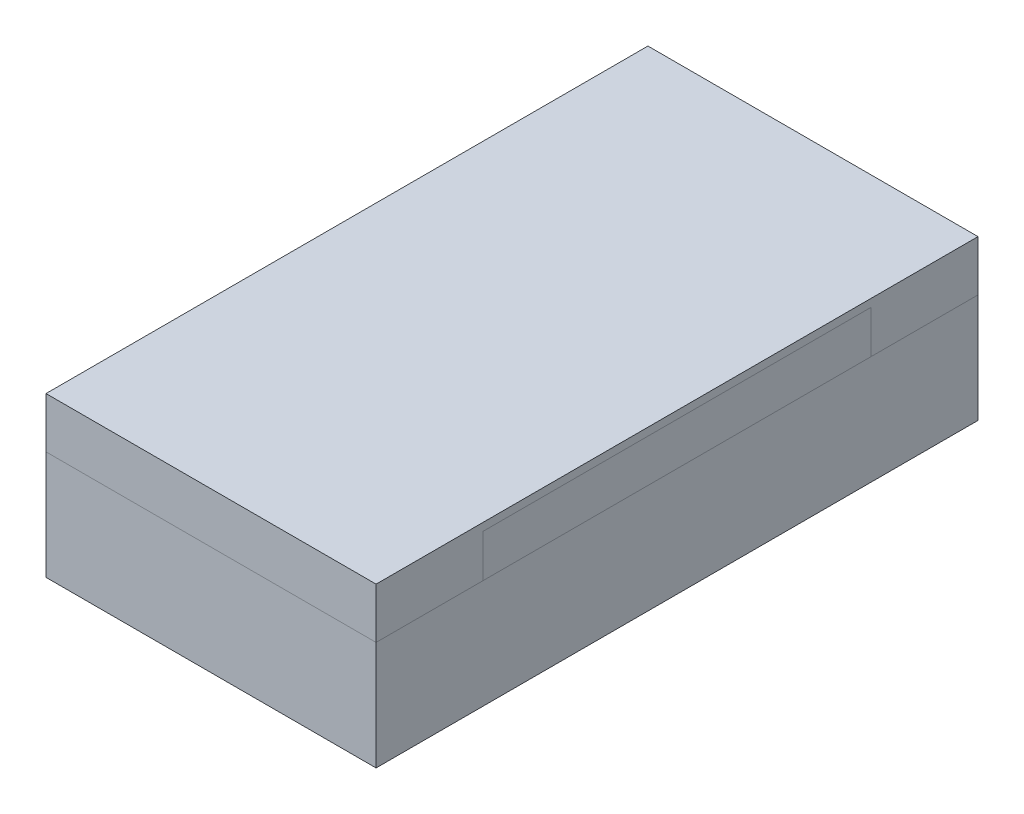
ISO-10303-21;
HEADER;
FILE_DESCRIPTION(('STEP AP214'),'2;1');
FILE_NAME('part.step','',(''),(''),'','','');
FILE_SCHEMA(('AUTOMOTIVE_DESIGN { 1 0 10303 214 1 1 1 1 }'));
ENDSEC;
DATA;
#1=APPLICATION_CONTEXT('core data for automotive mechanical design processes');
#2=APPLICATION_PROTOCOL_DEFINITION('international standard','automotive_design',2000,#1);
#3=PRODUCT_CONTEXT('',#1,'mechanical');
#4=PRODUCT('Part','Part','',(#3));
#5=PRODUCT_RELATED_PRODUCT_CATEGORY('part','',(#4));
#6=PRODUCT_DEFINITION_FORMATION('','',#4);
#7=PRODUCT_DEFINITION_CONTEXT('part definition',#1,'design');
#8=PRODUCT_DEFINITION('design','',#6,#7);
#9=PRODUCT_DEFINITION_SHAPE('','',#8);
#10=(LENGTH_UNIT() NAMED_UNIT(*) SI_UNIT(.MILLI.,.METRE.));
#11=(NAMED_UNIT(*) PLANE_ANGLE_UNIT() SI_UNIT($,.RADIAN.));
#12=(NAMED_UNIT(*) SI_UNIT($,.STERADIAN.) SOLID_ANGLE_UNIT());
#13=UNCERTAINTY_MEASURE_WITH_UNIT(LENGTH_MEASURE(1.E-05),#10,'distance_accuracy_value','');
#14=(GEOMETRIC_REPRESENTATION_CONTEXT(3) GLOBAL_UNCERTAINTY_ASSIGNED_CONTEXT((#13)) GLOBAL_UNIT_ASSIGNED_CONTEXT((#10,
#11,#12)) REPRESENTATION_CONTEXT('',''));
#15=CARTESIAN_POINT('',(0.,0.,0.));
#16=DIRECTION('',(0.,0.,1.));
#17=DIRECTION('',(1.,0.,0.));
#18=AXIS2_PLACEMENT_3D('',#15,#16,#17);
#19=CARTESIAN_POINT('',(-0.425,0.41,-0.5));
#20=DIRECTION('',(1.,0.,0.));
#21=DIRECTION('',(0.,0.,-1.));
#22=AXIS2_PLACEMENT_3D('',#19,#20,#21);
#23=PLANE('',#22);
#24=DIRECTION('',(0.,0.,1.));
#25=VECTOR('',#24,1.);
#26=CARTESIAN_POINT('',(-0.425,0.39,-0.5));
#27=LINE('',#26,#25);
#28=CARTESIAN_POINT('',(-0.425,0.39,-0.5));
#29=VERTEX_POINT('',#28);
#30=CARTESIAN_POINT('',(-0.425,0.39,0.5));
#31=VERTEX_POINT('',#30);
#32=EDGE_CURVE('E162',#29,#31,#27,.T.);
#33=ORIENTED_EDGE('',*,*,#32,.T.);
#34=DIRECTION('',(0.,-1.,0.));
#35=VECTOR('',#34,1.);
#36=CARTESIAN_POINT('',(-0.425,1.30337841926028,0.5));
#37=LINE('',#36,#35);
#38=CARTESIAN_POINT('',(-0.425,0.28,0.5));
#39=VERTEX_POINT('',#38);
#40=EDGE_CURVE('E144',#31,#39,#37,.T.);
#41=ORIENTED_EDGE('',*,*,#40,.T.);
#42=DIRECTION('',(0.,0.,1.));
#43=VECTOR('',#42,1.);
#44=CARTESIAN_POINT('',(-0.425,0.28,0.5));
#45=LINE('',#44,#43);
#46=CARTESIAN_POINT('',(-0.425,0.28,0.775));
#47=VERTEX_POINT('',#46);
#48=EDGE_CURVE('E123',#39,#47,#45,.T.);
#49=ORIENTED_EDGE('',*,*,#48,.T.);
#50=DIRECTION('',(0.,-1.,0.));
#51=VECTOR('',#50,1.);
#52=CARTESIAN_POINT('',(-0.425,1.30337841926028,0.775));
#53=LINE('',#52,#51);
#54=CARTESIAN_POINT('',(-0.425,0.41,0.775));
#55=VERTEX_POINT('',#54);
#56=EDGE_CURVE('E121',#55,#47,#53,.T.);
#57=ORIENTED_EDGE('',*,*,#56,.F.);
#58=DIRECTION('',(0.,0.,1.));
#59=VECTOR('',#58,1.);
#60=CARTESIAN_POINT('',(-0.425,0.41,-0.5));
#61=LINE('',#60,#59);
#62=CARTESIAN_POINT('',(-0.425,0.41,-0.775));
#63=VERTEX_POINT('',#62);
#64=EDGE_CURVE('E54',#63,#55,#61,.T.);
#65=ORIENTED_EDGE('',*,*,#64,.F.);
#66=DIRECTION('',(0.,-1.,0.));
#67=VECTOR('',#66,1.);
#68=CARTESIAN_POINT('',(-0.425,1.30337841926028,-0.775));
#69=LINE('',#68,#67);
#70=CARTESIAN_POINT('',(-0.425,0.28,-0.775));
#71=VERTEX_POINT('',#70);
#72=EDGE_CURVE('E154',#63,#71,#69,.T.);
#73=ORIENTED_EDGE('',*,*,#72,.T.);
#74=DIRECTION('',(0.,0.,1.));
#75=VECTOR('',#74,1.);
#76=CARTESIAN_POINT('',(-0.425,0.28,-0.775));
#77=LINE('',#76,#75);
#78=CARTESIAN_POINT('',(-0.425,0.28,-0.5));
#79=VERTEX_POINT('',#78);
#80=EDGE_CURVE('E151',#71,#79,#77,.T.);
#81=ORIENTED_EDGE('',*,*,#80,.T.);
#82=DIRECTION('',(0.,-1.,0.));
#83=VECTOR('',#82,1.);
#84=CARTESIAN_POINT('',(-0.425,1.30337841926028,-0.5));
#85=LINE('',#84,#83);
#86=EDGE_CURVE('E150',#29,#79,#85,.T.);
#87=ORIENTED_EDGE('',*,*,#86,.F.);
#88=EDGE_LOOP('',(#33,#41,#49,#57,#65,#73,#81,#87));
#89=FACE_BOUND('',#88,.T.);
#90=ADVANCED_FACE('F46',(#89),#23,.F.);
#91=CARTESIAN_POINT('',(0.425,0.41,-0.5));
#92=DIRECTION('',(-1.,0.,0.));
#93=DIRECTION('',(0.,0.,1.));
#94=AXIS2_PLACEMENT_3D('',#91,#92,#93);
#95=PLANE('',#94);
#96=DIRECTION('',(0.,0.,-1.));
#97=VECTOR('',#96,1.);
#98=CARTESIAN_POINT('',(0.425,0.39,-0.5));
#99=LINE('',#98,#97);
#100=CARTESIAN_POINT('',(0.425,0.39,0.5));
#101=VERTEX_POINT('',#100);
#102=CARTESIAN_POINT('',(0.425,0.39,-0.5));
#103=VERTEX_POINT('',#102);
#104=EDGE_CURVE('E62',#101,#103,#99,.T.);
#105=ORIENTED_EDGE('',*,*,#104,.T.);
#106=DIRECTION('',(0.,-1.,0.));
#107=VECTOR('',#106,1.);
#108=CARTESIAN_POINT('',(0.425,1.30337841926028,-0.5));
#109=LINE('',#108,#107);
#110=CARTESIAN_POINT('',(0.425,0.28,-0.5));
#111=VERTEX_POINT('',#110);
#112=EDGE_CURVE('E132',#103,#111,#109,.T.);
#113=ORIENTED_EDGE('',*,*,#112,.T.);
#114=DIRECTION('',(0.,0.,-1.));
#115=VECTOR('',#114,1.);
#116=CARTESIAN_POINT('',(0.425,0.28,-0.775));
#117=LINE('',#116,#115);
#118=CARTESIAN_POINT('',(0.425,0.28,-0.775));
#119=VERTEX_POINT('',#118);
#120=EDGE_CURVE('E134',#111,#119,#117,.T.);
#121=ORIENTED_EDGE('',*,*,#120,.T.);
#122=DIRECTION('',(0.,-1.,0.));
#123=VECTOR('',#122,1.);
#124=CARTESIAN_POINT('',(0.425,1.30337841926028,-0.775));
#125=LINE('',#124,#123);
#126=CARTESIAN_POINT('',(0.425,0.41,-0.775));
#127=VERTEX_POINT('',#126);
#128=EDGE_CURVE('E158',#127,#119,#125,.T.);
#129=ORIENTED_EDGE('',*,*,#128,.F.);
#130=DIRECTION('',(0.,0.,-1.));
#131=VECTOR('',#130,1.);
#132=CARTESIAN_POINT('',(0.425,0.41,-0.5));
#133=LINE('',#132,#131);
#134=CARTESIAN_POINT('',(0.425,0.41,0.775));
#135=VERTEX_POINT('',#134);
#136=EDGE_CURVE('E12',#135,#127,#133,.T.);
#137=ORIENTED_EDGE('',*,*,#136,.F.);
#138=DIRECTION('',(0.,-1.,0.));
#139=VECTOR('',#138,1.);
#140=CARTESIAN_POINT('',(0.425,1.30337841926028,0.775));
#141=LINE('',#140,#139);
#142=CARTESIAN_POINT('',(0.425,0.28,0.775));
#143=VERTEX_POINT('',#142);
#144=EDGE_CURVE('E131',#135,#143,#141,.T.);
#145=ORIENTED_EDGE('',*,*,#144,.T.);
#146=DIRECTION('',(0.,0.,-1.));
#147=VECTOR('',#146,1.);
#148=CARTESIAN_POINT('',(0.425,0.28,0.5));
#149=LINE('',#148,#147);
#150=CARTESIAN_POINT('',(0.425,0.28,0.5));
#151=VERTEX_POINT('',#150);
#152=EDGE_CURVE('E139',#143,#151,#149,.T.);
#153=ORIENTED_EDGE('',*,*,#152,.T.);
#154=DIRECTION('',(0.,-1.,0.));
#155=VECTOR('',#154,1.);
#156=CARTESIAN_POINT('',(0.425,1.30337841926028,0.5));
#157=LINE('',#156,#155);
#158=EDGE_CURVE('E141',#101,#151,#157,.T.);
#159=ORIENTED_EDGE('',*,*,#158,.F.);
#160=EDGE_LOOP('',(#105,#113,#121,#129,#137,#145,#153,#159));
#161=FACE_BOUND('',#160,.T.);
#162=ADVANCED_FACE('F180',(#161),#95,.F.);
#163=CARTESIAN_POINT('',(0.,0.41,0.));
#164=DIRECTION('',(0.,1.,0.));
#165=DIRECTION('',(0.,0.,1.));
#166=AXIS2_PLACEMENT_3D('',#163,#164,#165);
#167=PLANE('',#166);
#168=ORIENTED_EDGE('',*,*,#64,.T.);
#169=DIRECTION('',(1.,0.,0.));
#170=VECTOR('',#169,1.);
#171=CARTESIAN_POINT('',(0.425,0.41,0.775));
#172=LINE('',#171,#170);
#173=EDGE_CURVE('E114',#55,#135,#172,.T.);
#174=ORIENTED_EDGE('',*,*,#173,.T.);
#175=ORIENTED_EDGE('',*,*,#136,.T.);
#176=DIRECTION('',(-1.,0.,0.));
#177=VECTOR('',#176,1.);
#178=CARTESIAN_POINT('',(0.425,0.41,-0.775));
#179=LINE('',#178,#177);
#180=EDGE_CURVE('E116',#127,#63,#179,.T.);
#181=ORIENTED_EDGE('',*,*,#180,.T.);
#182=EDGE_LOOP('',(#168,#174,#175,#181));
#183=FACE_BOUND('',#182,.T.);
#184=ADVANCED_FACE('F112',(#183),#167,.T.);
#185=CARTESIAN_POINT('',(0.,0.39,0.));
#186=DIRECTION('',(0.,1.,0.));
#187=DIRECTION('',(0.,0.,1.));
#188=AXIS2_PLACEMENT_3D('',#185,#186,#187);
#189=PLANE('',#188);
#190=ORIENTED_EDGE('',*,*,#32,.F.);
#191=DIRECTION('',(-1.,0.,0.));
#192=VECTOR('',#191,1.);
#193=CARTESIAN_POINT('',(-0.425,0.39,-0.5));
#194=LINE('',#193,#192);
#195=EDGE_CURVE('E49',#103,#29,#194,.T.);
#196=ORIENTED_EDGE('',*,*,#195,.F.);
#197=ORIENTED_EDGE('',*,*,#104,.F.);
#198=DIRECTION('',(1.,0.,0.));
#199=VECTOR('',#198,1.);
#200=CARTESIAN_POINT('',(-0.425,0.39,0.5));
#201=LINE('',#200,#199);
#202=EDGE_CURVE('E69',#31,#101,#201,.T.);
#203=ORIENTED_EDGE('',*,*,#202,.F.);
#204=EDGE_LOOP('',(#190,#196,#197,#203));
#205=FACE_BOUND('',#204,.T.);
#206=ADVANCED_FACE('F191',(#205),#189,.F.);
#207=CARTESIAN_POINT('',(0.425,1.30337841926028,-0.5));
#208=DIRECTION('',(0.,0.,-1.));
#209=DIRECTION('',(-1.,0.,0.));
#210=AXIS2_PLACEMENT_3D('',#207,#208,#209);
#211=PLANE('',#210);
#212=ORIENTED_EDGE('',*,*,#112,.F.);
#213=ORIENTED_EDGE('',*,*,#195,.T.);
#214=ORIENTED_EDGE('',*,*,#86,.T.);
#215=DIRECTION('',(1.,0.,0.));
#216=VECTOR('',#215,1.);
#217=CARTESIAN_POINT('',(0.425,0.28,-0.5));
#218=LINE('',#217,#216);
#219=EDGE_CURVE('E147',#79,#111,#218,.T.);
#220=ORIENTED_EDGE('',*,*,#219,.T.);
#221=EDGE_LOOP('',(#212,#213,#214,#220));
#222=FACE_BOUND('',#221,.T.);
#223=ADVANCED_FACE('F171',(#222),#211,.F.);
#224=CARTESIAN_POINT('',(0.425,1.30337841926028,-0.775));
#225=DIRECTION('',(0.,0.,1.));
#226=DIRECTION('',(1.,0.,0.));
#227=AXIS2_PLACEMENT_3D('',#224,#225,#226);
#228=PLANE('',#227);
#229=ORIENTED_EDGE('',*,*,#180,.F.);
#230=ORIENTED_EDGE('',*,*,#128,.T.);
#231=DIRECTION('',(-1.,0.,0.));
#232=VECTOR('',#231,1.);
#233=CARTESIAN_POINT('',(0.425,0.28,-0.775));
#234=LINE('',#233,#232);
#235=EDGE_CURVE('E155',#119,#71,#234,.T.);
#236=ORIENTED_EDGE('',*,*,#235,.T.);
#237=ORIENTED_EDGE('',*,*,#72,.F.);
#238=EDGE_LOOP('',(#229,#230,#236,#237));
#239=FACE_BOUND('',#238,.T.);
#240=ADVANCED_FACE('F182',(#239),#228,.F.);
#241=CARTESIAN_POINT('',(0.,0.28,0.));
#242=DIRECTION('',(0.,-1.,0.));
#243=DIRECTION('',(0.,0.,-1.));
#244=AXIS2_PLACEMENT_3D('',#241,#242,#243);
#245=PLANE('',#244);
#246=ORIENTED_EDGE('',*,*,#120,.F.);
#247=ORIENTED_EDGE('',*,*,#219,.F.);
#248=ORIENTED_EDGE('',*,*,#80,.F.);
#249=ORIENTED_EDGE('',*,*,#235,.F.);
#250=EDGE_LOOP('',(#246,#247,#248,#249));
#251=FACE_BOUND('',#250,.T.);
#252=ADVANCED_FACE('F178',(#251),#245,.T.);
#253=CARTESIAN_POINT('',(0.425,1.30337841926028,0.5));
#254=DIRECTION('',(0.,0.,1.));
#255=DIRECTION('',(1.,0.,0.));
#256=AXIS2_PLACEMENT_3D('',#253,#254,#255);
#257=PLANE('',#256);
#258=ORIENTED_EDGE('',*,*,#40,.F.);
#259=ORIENTED_EDGE('',*,*,#202,.T.);
#260=ORIENTED_EDGE('',*,*,#158,.T.);
#261=DIRECTION('',(-1.,0.,0.));
#262=VECTOR('',#261,1.);
#263=CARTESIAN_POINT('',(0.425,0.28,0.5));
#264=LINE('',#263,#262);
#265=EDGE_CURVE('E143',#151,#39,#264,.T.);
#266=ORIENTED_EDGE('',*,*,#265,.T.);
#267=EDGE_LOOP('',(#258,#259,#260,#266));
#268=FACE_BOUND('',#267,.T.);
#269=ADVANCED_FACE('F189',(#268),#257,.F.);
#270=CARTESIAN_POINT('',(0.425,1.30337841926028,0.775));
#271=DIRECTION('',(0.,0.,-1.));
#272=DIRECTION('',(-1.,0.,0.));
#273=AXIS2_PLACEMENT_3D('',#270,#271,#272);
#274=PLANE('',#273);
#275=ORIENTED_EDGE('',*,*,#173,.F.);
#276=ORIENTED_EDGE('',*,*,#56,.T.);
#277=DIRECTION('',(1.,0.,0.));
#278=VECTOR('',#277,1.);
#279=CARTESIAN_POINT('',(0.425,0.28,0.775));
#280=LINE('',#279,#278);
#281=EDGE_CURVE('E127',#47,#143,#280,.T.);
#282=ORIENTED_EDGE('',*,*,#281,.T.);
#283=ORIENTED_EDGE('',*,*,#144,.F.);
#284=EDGE_LOOP('',(#275,#276,#282,#283));
#285=FACE_BOUND('',#284,.T.);
#286=ADVANCED_FACE('F130',(#285),#274,.F.);
#287=CARTESIAN_POINT('',(0.,0.28,0.));
#288=DIRECTION('',(0.,-1.,0.));
#289=DIRECTION('',(0.,0.,-1.));
#290=AXIS2_PLACEMENT_3D('',#287,#288,#289);
#291=PLANE('',#290);
#292=ORIENTED_EDGE('',*,*,#152,.F.);
#293=ORIENTED_EDGE('',*,*,#281,.F.);
#294=ORIENTED_EDGE('',*,*,#48,.F.);
#295=ORIENTED_EDGE('',*,*,#265,.F.);
#296=EDGE_LOOP('',(#292,#293,#294,#295));
#297=FACE_BOUND('',#296,.T.);
#298=ADVANCED_FACE('F240',(#297),#291,.T.);
#299=CLOSED_SHELL('',(#90,#162,#184,#206,#223,#240,#252,#269,#286,#298));
#300=MANIFOLD_SOLID_BREP('B2',#299);
#301=CARTESIAN_POINT('',(0.425,0.39,-0.5));
#302=DIRECTION('',(-1.,0.,0.));
#303=DIRECTION('',(0.,0.,1.));
#304=AXIS2_PLACEMENT_3D('',#301,#302,#303);
#305=PLANE('',#304);
#306=DIRECTION('',(0.,0.,-1.));
#307=VECTOR('',#306,1.);
#308=CARTESIAN_POINT('',(0.425,0.28,-0.5));
#309=LINE('',#308,#307);
#310=CARTESIAN_POINT('',(0.425,0.28,0.5));
#311=VERTEX_POINT('',#310);
#312=CARTESIAN_POINT('',(0.425,0.28,-0.5));
#313=VERTEX_POINT('',#312);
#314=EDGE_CURVE('E364',#311,#313,#309,.T.);
#315=ORIENTED_EDGE('',*,*,#314,.T.);
#316=DIRECTION('',(0.,-1.,0.));
#317=VECTOR('',#316,1.);
#318=CARTESIAN_POINT('',(0.425,0.39,-0.5));
#319=LINE('',#318,#317);
#320=CARTESIAN_POINT('',(0.425,0.39,-0.5));
#321=VERTEX_POINT('',#320);
#322=EDGE_CURVE('E44',#321,#313,#319,.T.);
#323=ORIENTED_EDGE('',*,*,#322,.F.);
#324=DIRECTION('',(0.,0.,-1.));
#325=VECTOR('',#324,1.);
#326=CARTESIAN_POINT('',(0.425,0.39,-0.5));
#327=LINE('',#326,#325);
#328=CARTESIAN_POINT('',(0.425,0.39,0.5));
#329=VERTEX_POINT('',#328);
#330=EDGE_CURVE('E352',#329,#321,#327,.T.);
#331=ORIENTED_EDGE('',*,*,#330,.F.);
#332=DIRECTION('',(0.,-1.,0.));
#333=VECTOR('',#332,1.);
#334=CARTESIAN_POINT('',(0.425,0.39,0.5));
#335=LINE('',#334,#333);
#336=EDGE_CURVE('E360',#329,#311,#335,.T.);
#337=ORIENTED_EDGE('',*,*,#336,.T.);
#338=EDGE_LOOP('',(#315,#323,#331,#337));
#339=FACE_BOUND('',#338,.T.);
#340=ADVANCED_FACE('F301',(#339),#305,.F.);
#341=CARTESIAN_POINT('',(0.425,0.39,-0.5));
#342=DIRECTION('',(0.,0.,1.));
#343=DIRECTION('',(1.,0.,0.));
#344=AXIS2_PLACEMENT_3D('',#341,#342,#343);
#345=PLANE('',#344);
#346=DIRECTION('',(-1.,0.,0.));
#347=VECTOR('',#346,1.);
#348=CARTESIAN_POINT('',(0.425,0.28,-0.5));
#349=LINE('',#348,#347);
#350=CARTESIAN_POINT('',(-0.425,0.28,-0.5));
#351=VERTEX_POINT('',#350);
#352=EDGE_CURVE('E356',#313,#351,#349,.T.);
#353=ORIENTED_EDGE('',*,*,#352,.T.);
#354=DIRECTION('',(0.,-1.,0.));
#355=VECTOR('',#354,1.);
#356=CARTESIAN_POINT('',(-0.425,0.39,-0.5));
#357=LINE('',#356,#355);
#358=CARTESIAN_POINT('',(-0.425,0.39,-0.5));
#359=VERTEX_POINT('',#358);
#360=EDGE_CURVE('E309',#359,#351,#357,.T.);
#361=ORIENTED_EDGE('',*,*,#360,.F.);
#362=DIRECTION('',(-1.,0.,0.));
#363=VECTOR('',#362,1.);
#364=CARTESIAN_POINT('',(0.425,0.39,-0.5));
#365=LINE('',#364,#363);
#366=EDGE_CURVE('E347',#321,#359,#365,.T.);
#367=ORIENTED_EDGE('',*,*,#366,.F.);
#368=ORIENTED_EDGE('',*,*,#322,.T.);
#369=EDGE_LOOP('',(#353,#361,#367,#368));
#370=FACE_BOUND('',#369,.T.);
#371=ADVANCED_FACE('F355',(#370),#345,.F.);
#372=CARTESIAN_POINT('',(-0.425,0.39,-0.5));
#373=DIRECTION('',(1.,0.,0.));
#374=DIRECTION('',(0.,0.,-1.));
#375=AXIS2_PLACEMENT_3D('',#372,#373,#374);
#376=PLANE('',#375);
#377=DIRECTION('',(0.,0.,1.));
#378=VECTOR('',#377,1.);
#379=CARTESIAN_POINT('',(-0.425,0.28,-0.5));
#380=LINE('',#379,#378);
#381=CARTESIAN_POINT('',(-0.425,0.28,0.5));
#382=VERTEX_POINT('',#381);
#383=EDGE_CURVE('E334',#351,#382,#380,.T.);
#384=ORIENTED_EDGE('',*,*,#383,.T.);
#385=DIRECTION('',(0.,-1.,0.));
#386=VECTOR('',#385,1.);
#387=CARTESIAN_POINT('',(-0.425,0.39,0.5));
#388=LINE('',#387,#386);
#389=CARTESIAN_POINT('',(-0.425,0.39,0.5));
#390=VERTEX_POINT('',#389);
#391=EDGE_CURVE('E357',#390,#382,#388,.T.);
#392=ORIENTED_EDGE('',*,*,#391,.F.);
#393=DIRECTION('',(0.,0.,1.));
#394=VECTOR('',#393,1.);
#395=CARTESIAN_POINT('',(-0.425,0.39,-0.5));
#396=LINE('',#395,#394);
#397=EDGE_CURVE('E350',#359,#390,#396,.T.);
#398=ORIENTED_EDGE('',*,*,#397,.F.);
#399=ORIENTED_EDGE('',*,*,#360,.T.);
#400=EDGE_LOOP('',(#384,#392,#398,#399));
#401=FACE_BOUND('',#400,.T.);
#402=ADVANCED_FACE('F358',(#401),#376,.F.);
#403=CARTESIAN_POINT('',(0.425,0.39,0.5));
#404=DIRECTION('',(0.,0.,-1.));
#405=DIRECTION('',(-1.,0.,0.));
#406=AXIS2_PLACEMENT_3D('',#403,#404,#405);
#407=PLANE('',#406);
#408=DIRECTION('',(1.,0.,0.));
#409=VECTOR('',#408,1.);
#410=CARTESIAN_POINT('',(0.425,0.28,0.5));
#411=LINE('',#410,#409);
#412=EDGE_CURVE('E340',#382,#311,#411,.T.);
#413=ORIENTED_EDGE('',*,*,#412,.T.);
#414=ORIENTED_EDGE('',*,*,#336,.F.);
#415=DIRECTION('',(1.,0.,0.));
#416=VECTOR('',#415,1.);
#417=CARTESIAN_POINT('',(0.425,0.39,0.5));
#418=LINE('',#417,#416);
#419=EDGE_CURVE('E317',#390,#329,#418,.T.);
#420=ORIENTED_EDGE('',*,*,#419,.F.);
#421=ORIENTED_EDGE('',*,*,#391,.T.);
#422=EDGE_LOOP('',(#413,#414,#420,#421));
#423=FACE_BOUND('',#422,.T.);
#424=ADVANCED_FACE('F371',(#423),#407,.F.);
#425=CARTESIAN_POINT('',(0.,0.39,0.));
#426=DIRECTION('',(0.,-1.,0.));
#427=DIRECTION('',(0.,0.,-1.));
#428=AXIS2_PLACEMENT_3D('',#425,#426,#427);
#429=PLANE('',#428);
#430=ORIENTED_EDGE('',*,*,#330,.T.);
#431=ORIENTED_EDGE('',*,*,#366,.T.);
#432=ORIENTED_EDGE('',*,*,#397,.T.);
#433=ORIENTED_EDGE('',*,*,#419,.T.);
#434=EDGE_LOOP('',(#430,#431,#432,#433));
#435=FACE_BOUND('',#434,.T.);
#436=ADVANCED_FACE('F348',(#435),#429,.F.);
#437=CARTESIAN_POINT('',(0.,0.28,0.));
#438=DIRECTION('',(0.,-1.,0.));
#439=DIRECTION('',(0.,0.,-1.));
#440=AXIS2_PLACEMENT_3D('',#437,#438,#439);
#441=PLANE('',#440);
#442=ORIENTED_EDGE('',*,*,#314,.F.);
#443=ORIENTED_EDGE('',*,*,#412,.F.);
#444=ORIENTED_EDGE('',*,*,#383,.F.);
#445=ORIENTED_EDGE('',*,*,#352,.F.);
#446=EDGE_LOOP('',(#442,#443,#444,#445));
#447=FACE_BOUND('',#446,.T.);
#448=ADVANCED_FACE('F374',(#447),#441,.T.);
#449=CLOSED_SHELL('',(#340,#371,#402,#424,#436,#448));
#450=MANIFOLD_SOLID_BREP('B6',#449);
#451=CARTESIAN_POINT('',(0.425,0.28,0.775));
#452=DIRECTION('',(-1.,0.,0.));
#453=DIRECTION('',(0.,0.,1.));
#454=AXIS2_PLACEMENT_3D('',#451,#452,#453);
#455=PLANE('',#454);
#456=DIRECTION('',(0.,0.,-1.));
#457=VECTOR('',#456,1.);
#458=CARTESIAN_POINT('',(0.425,0.,0.775));
#459=LINE('',#458,#457);
#460=CARTESIAN_POINT('',(0.425,0.,0.775));
#461=VERTEX_POINT('',#460);
#462=CARTESIAN_POINT('',(0.425,0.,-0.775));
#463=VERTEX_POINT('',#462);
#464=EDGE_CURVE('E488',#461,#463,#459,.T.);
#465=ORIENTED_EDGE('',*,*,#464,.T.);
#466=DIRECTION('',(0.,-1.,0.));
#467=VECTOR('',#466,1.);
#468=CARTESIAN_POINT('',(0.425,0.28,-0.775));
#469=LINE('',#468,#467);
#470=CARTESIAN_POINT('',(0.425,0.28,-0.775));
#471=VERTEX_POINT('',#470);
#472=EDGE_CURVE('E299',#471,#463,#469,.T.);
#473=ORIENTED_EDGE('',*,*,#472,.F.);
#474=DIRECTION('',(0.,0.,-1.));
#475=VECTOR('',#474,1.);
#476=CARTESIAN_POINT('',(0.425,0.28,0.775));
#477=LINE('',#476,#475);
#478=CARTESIAN_POINT('',(0.425,0.28,0.775));
#479=VERTEX_POINT('',#478);
#480=EDGE_CURVE('E476',#479,#471,#477,.T.);
#481=ORIENTED_EDGE('',*,*,#480,.F.);
#482=DIRECTION('',(0.,-1.,0.));
#483=VECTOR('',#482,1.);
#484=CARTESIAN_POINT('',(0.425,0.28,0.775));
#485=LINE('',#484,#483);
#486=EDGE_CURVE('E484',#479,#461,#485,.T.);
#487=ORIENTED_EDGE('',*,*,#486,.T.);
#488=EDGE_LOOP('',(#465,#473,#481,#487));
#489=FACE_BOUND('',#488,.T.);
#490=ADVANCED_FACE('F425',(#489),#455,.F.);
#491=CARTESIAN_POINT('',(-0.425,0.28,-0.775));
#492=DIRECTION('',(0.,0.,1.));
#493=DIRECTION('',(1.,0.,0.));
#494=AXIS2_PLACEMENT_3D('',#491,#492,#493);
#495=PLANE('',#494);
#496=DIRECTION('',(-1.,0.,0.));
#497=VECTOR('',#496,1.);
#498=CARTESIAN_POINT('',(-0.425,0.,-0.775));
#499=LINE('',#498,#497);
#500=CARTESIAN_POINT('',(-0.425,0.,-0.775));
#501=VERTEX_POINT('',#500);
#502=EDGE_CURVE('E480',#463,#501,#499,.T.);
#503=ORIENTED_EDGE('',*,*,#502,.T.);
#504=DIRECTION('',(0.,-1.,0.));
#505=VECTOR('',#504,1.);
#506=CARTESIAN_POINT('',(-0.425,0.28,-0.775));
#507=LINE('',#506,#505);
#508=CARTESIAN_POINT('',(-0.425,0.28,-0.775));
#509=VERTEX_POINT('',#508);
#510=EDGE_CURVE('E433',#509,#501,#507,.T.);
#511=ORIENTED_EDGE('',*,*,#510,.F.);
#512=DIRECTION('',(-1.,0.,0.));
#513=VECTOR('',#512,1.);
#514=CARTESIAN_POINT('',(-0.425,0.28,-0.775));
#515=LINE('',#514,#513);
#516=EDGE_CURVE('E471',#471,#509,#515,.T.);
#517=ORIENTED_EDGE('',*,*,#516,.F.);
#518=ORIENTED_EDGE('',*,*,#472,.T.);
#519=EDGE_LOOP('',(#503,#511,#517,#518));
#520=FACE_BOUND('',#519,.T.);
#521=ADVANCED_FACE('F479',(#520),#495,.F.);
#522=CARTESIAN_POINT('',(-0.425,0.28,0.775));
#523=DIRECTION('',(1.,0.,0.));
#524=DIRECTION('',(0.,0.,-1.));
#525=AXIS2_PLACEMENT_3D('',#522,#523,#524);
#526=PLANE('',#525);
#527=DIRECTION('',(0.,0.,1.));
#528=VECTOR('',#527,1.);
#529=CARTESIAN_POINT('',(-0.425,0.,0.775));
#530=LINE('',#529,#528);
#531=CARTESIAN_POINT('',(-0.425,0.,0.775));
#532=VERTEX_POINT('',#531);
#533=EDGE_CURVE('E458',#501,#532,#530,.T.);
#534=ORIENTED_EDGE('',*,*,#533,.T.);
#535=DIRECTION('',(0.,-1.,0.));
#536=VECTOR('',#535,1.);
#537=CARTESIAN_POINT('',(-0.425,0.28,0.775));
#538=LINE('',#537,#536);
#539=CARTESIAN_POINT('',(-0.425,0.28,0.775));
#540=VERTEX_POINT('',#539);
#541=EDGE_CURVE('E481',#540,#532,#538,.T.);
#542=ORIENTED_EDGE('',*,*,#541,.F.);
#543=DIRECTION('',(0.,0.,1.));
#544=VECTOR('',#543,1.);
#545=CARTESIAN_POINT('',(-0.425,0.28,0.775));
#546=LINE('',#545,#544);
#547=EDGE_CURVE('E474',#509,#540,#546,.T.);
#548=ORIENTED_EDGE('',*,*,#547,.F.);
#549=ORIENTED_EDGE('',*,*,#510,.T.);
#550=EDGE_LOOP('',(#534,#542,#548,#549));
#551=FACE_BOUND('',#550,.T.);
#552=ADVANCED_FACE('F482',(#551),#526,.F.);
#553=CARTESIAN_POINT('',(-0.425,0.28,0.775));
#554=DIRECTION('',(0.,0.,-1.));
#555=DIRECTION('',(-1.,0.,0.));
#556=AXIS2_PLACEMENT_3D('',#553,#554,#555);
#557=PLANE('',#556);
#558=DIRECTION('',(1.,0.,0.));
#559=VECTOR('',#558,1.);
#560=CARTESIAN_POINT('',(-0.425,0.,0.775));
#561=LINE('',#560,#559);
#562=EDGE_CURVE('E464',#532,#461,#561,.T.);
#563=ORIENTED_EDGE('',*,*,#562,.T.);
#564=ORIENTED_EDGE('',*,*,#486,.F.);
#565=DIRECTION('',(1.,0.,0.));
#566=VECTOR('',#565,1.);
#567=CARTESIAN_POINT('',(-0.425,0.28,0.775));
#568=LINE('',#567,#566);
#569=EDGE_CURVE('E441',#540,#479,#568,.T.);
#570=ORIENTED_EDGE('',*,*,#569,.F.);
#571=ORIENTED_EDGE('',*,*,#541,.T.);
#572=EDGE_LOOP('',(#563,#564,#570,#571));
#573=FACE_BOUND('',#572,.T.);
#574=ADVANCED_FACE('F495',(#573),#557,.F.);
#575=CARTESIAN_POINT('',(0.,0.28,0.));
#576=DIRECTION('',(0.,-1.,0.));
#577=DIRECTION('',(0.,0.,-1.));
#578=AXIS2_PLACEMENT_3D('',#575,#576,#577);
#579=PLANE('',#578);
#580=ORIENTED_EDGE('',*,*,#480,.T.);
#581=ORIENTED_EDGE('',*,*,#516,.T.);
#582=ORIENTED_EDGE('',*,*,#547,.T.);
#583=ORIENTED_EDGE('',*,*,#569,.T.);
#584=EDGE_LOOP('',(#580,#581,#582,#583));
#585=FACE_BOUND('',#584,.T.);
#586=ADVANCED_FACE('F472',(#585),#579,.F.);
#587=CARTESIAN_POINT('',(0.,0.,0.));
#588=DIRECTION('',(0.,-1.,0.));
#589=DIRECTION('',(0.,0.,-1.));
#590=AXIS2_PLACEMENT_3D('',#587,#588,#589);
#591=PLANE('',#590);
#592=ORIENTED_EDGE('',*,*,#464,.F.);
#593=ORIENTED_EDGE('',*,*,#562,.F.);
#594=ORIENTED_EDGE('',*,*,#533,.F.);
#595=ORIENTED_EDGE('',*,*,#502,.F.);
#596=EDGE_LOOP('',(#592,#593,#594,#595));
#597=FACE_BOUND('',#596,.T.);
#598=ADVANCED_FACE('F498',(#597),#591,.T.);
#599=CLOSED_SHELL('',(#490,#521,#552,#574,#586,#598));
#600=MANIFOLD_SOLID_BREP('B38',#599);
#601=ADVANCED_BREP_SHAPE_REPRESENTATION('',(#18,#300,#450,#600),#14);
#602=SHAPE_DEFINITION_REPRESENTATION(#9,#601);
ENDSEC;
END-ISO-10303-21;
